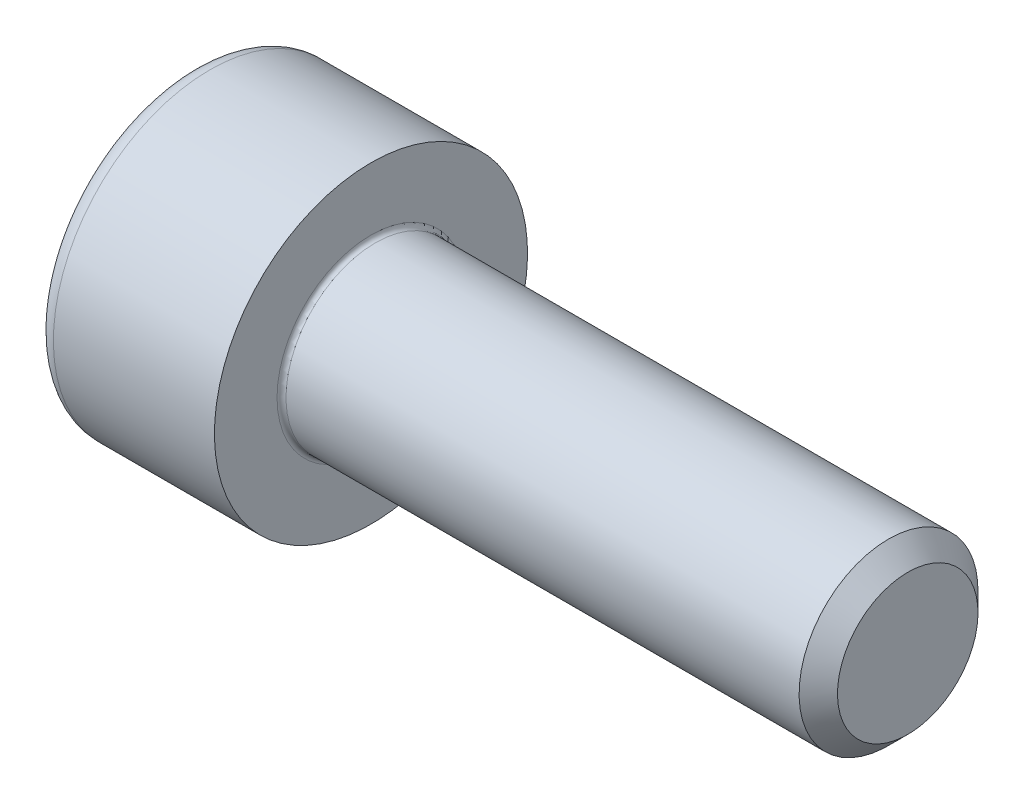
ISO-10303-21;
HEADER;
FILE_DESCRIPTION(('STEP AP214'),'2;1');
FILE_NAME('part.step','',(''),(''),'','','');
FILE_SCHEMA(('AUTOMOTIVE_DESIGN { 1 0 10303 214 1 1 1 1 }'));
ENDSEC;
DATA;
#1=APPLICATION_CONTEXT('core data for automotive mechanical design processes');
#2=APPLICATION_PROTOCOL_DEFINITION('international standard','automotive_design',2000,#1);
#3=PRODUCT_CONTEXT('',#1,'mechanical');
#4=PRODUCT('Part','Part','',(#3));
#5=PRODUCT_RELATED_PRODUCT_CATEGORY('part','',(#4));
#6=PRODUCT_DEFINITION_FORMATION('','',#4);
#7=PRODUCT_DEFINITION_CONTEXT('part definition',#1,'design');
#8=PRODUCT_DEFINITION('design','',#6,#7);
#9=PRODUCT_DEFINITION_SHAPE('','',#8);
#10=(LENGTH_UNIT() NAMED_UNIT(*) SI_UNIT(.MILLI.,.METRE.));
#11=(NAMED_UNIT(*) PLANE_ANGLE_UNIT() SI_UNIT($,.RADIAN.));
#12=(NAMED_UNIT(*) SI_UNIT($,.STERADIAN.) SOLID_ANGLE_UNIT());
#13=UNCERTAINTY_MEASURE_WITH_UNIT(LENGTH_MEASURE(1.E-05),#10,'distance_accuracy_value','');
#14=(GEOMETRIC_REPRESENTATION_CONTEXT(3) GLOBAL_UNCERTAINTY_ASSIGNED_CONTEXT((#13)) GLOBAL_UNIT_ASSIGNED_CONTEXT((#10,
#11,#12)) REPRESENTATION_CONTEXT('',''));
#15=CARTESIAN_POINT('',(0.,0.,0.));
#16=DIRECTION('',(0.,0.,1.));
#17=DIRECTION('',(1.,0.,0.));
#18=AXIS2_PLACEMENT_3D('',#15,#16,#17);
#19=CARTESIAN_POINT('',(0.100000000000002,0.,0.));
#20=DIRECTION('',(1.,0.,0.));
#21=DIRECTION('',(0.,1.,0.));
#22=AXIS2_PLACEMENT_3D('',#19,#20,#21);
#23=TOROIDAL_SURFACE('',#22,2.1,0.1);
#24=CARTESIAN_POINT('',(0.,0.,0.));
#25=DIRECTION('',(1.,0.,0.));
#26=DIRECTION('',(0.,1.,0.));
#27=AXIS2_PLACEMENT_3D('',#24,#25,#26);
#28=CIRCLE('',#27,2.1);
#29=CARTESIAN_POINT('',(0.,2.1,0.));
#30=VERTEX_POINT('',#29);
#31=EDGE_CURVE('E9',#30,#30,#28,.T.);
#32=ORIENTED_EDGE('',*,*,#31,.T.);
#33=EDGE_LOOP('',(#32));
#34=FACE_BOUND('',#33,.T.);
#35=CARTESIAN_POINT('',(0.100000000000002,0.,0.));
#36=DIRECTION('',(-1.,0.,0.));
#37=DIRECTION('',(0.,1.,0.));
#38=AXIS2_PLACEMENT_3D('',#35,#36,#37);
#39=CIRCLE('',#38,2.);
#40=CARTESIAN_POINT('',(0.100000000000002,2.,0.));
#41=VERTEX_POINT('',#40);
#42=EDGE_CURVE('E26',#41,#41,#39,.T.);
#43=ORIENTED_EDGE('',*,*,#42,.T.);
#44=EDGE_LOOP('',(#43));
#45=FACE_BOUND('',#44,.T.);
#46=ADVANCED_FACE('F15',(#34,#45),#23,.F.);
#47=CARTESIAN_POINT('',(6.9147075,0.,0.));
#48=DIRECTION('',(1.,0.,0.));
#49=DIRECTION('',(0.,1.,0.));
#50=AXIS2_PLACEMENT_3D('',#47,#48,#49);
#51=CYLINDRICAL_SURFACE('',#50,2.);
#52=CARTESIAN_POINT('',(11.570585,0.,0.));
#53=DIRECTION('',(1.,0.,0.));
#54=DIRECTION('',(0.,1.,0.));
#55=AXIS2_PLACEMENT_3D('',#52,#53,#54);
#56=CIRCLE('',#55,2.);
#57=CARTESIAN_POINT('',(11.570585,2.,0.));
#58=VERTEX_POINT('',#57);
#59=EDGE_CURVE('E160',#58,#58,#56,.T.);
#60=ORIENTED_EDGE('',*,*,#59,.F.);
#61=EDGE_LOOP('',(#60));
#62=FACE_BOUND('',#61,.T.);
#63=ORIENTED_EDGE('',*,*,#42,.F.);
#64=EDGE_LOOP('',(#63));
#65=FACE_BOUND('',#64,.T.);
#66=ADVANCED_FACE('F170',(#62,#65),#51,.T.);
#67=CARTESIAN_POINT('',(0.,2.75,0.));
#68=DIRECTION('',(1.,0.,0.));
#69=DIRECTION('',(0.,1.,0.));
#70=AXIS2_PLACEMENT_3D('',#67,#68,#69);
#71=PLANE('',#70);
#72=CARTESIAN_POINT('',(0.,0.,0.));
#73=DIRECTION('',(1.,0.,0.));
#74=DIRECTION('',(0.,1.,0.));
#75=AXIS2_PLACEMENT_3D('',#72,#73,#74);
#76=CIRCLE('',#75,3.5);
#77=CARTESIAN_POINT('',(0.,3.5,0.));
#78=VERTEX_POINT('',#77);
#79=EDGE_CURVE('E161',#78,#78,#76,.T.);
#80=ORIENTED_EDGE('',*,*,#79,.T.);
#81=EDGE_LOOP('',(#80));
#82=FACE_BOUND('',#81,.T.);
#83=ORIENTED_EDGE('',*,*,#31,.F.);
#84=EDGE_LOOP('',(#83));
#85=FACE_BOUND('',#84,.T.);
#86=ADVANCED_FACE('F172',(#82,#85),#71,.T.);
#87=CARTESIAN_POINT('',(11.7852925,0.,0.));
#88=DIRECTION('',(-1.,0.,0.));
#89=DIRECTION('',(0.,1.,0.));
#90=AXIS2_PLACEMENT_3D('',#87,#88,#89);
#91=CONICAL_SURFACE('',#90,1.7852925,0.785398163397448);
#92=ORIENTED_EDGE('',*,*,#59,.T.);
#93=EDGE_LOOP('',(#92));
#94=FACE_BOUND('',#93,.T.);
#95=CARTESIAN_POINT('',(12.,0.,0.));
#96=DIRECTION('',(-1.,0.,0.));
#97=DIRECTION('',(0.,1.,0.));
#98=AXIS2_PLACEMENT_3D('',#95,#96,#97);
#99=CIRCLE('',#98,1.570585);
#100=CARTESIAN_POINT('',(12.,1.570585,0.));
#101=VERTEX_POINT('',#100);
#102=EDGE_CURVE('E157',#101,#101,#99,.T.);
#103=ORIENTED_EDGE('',*,*,#102,.T.);
#104=EDGE_LOOP('',(#103));
#105=FACE_BOUND('',#104,.T.);
#106=ADVANCED_FACE('F180',(#94,#105),#91,.T.);
#107=CARTESIAN_POINT('',(12.,1.,0.));
#108=DIRECTION('',(1.,0.,0.));
#109=DIRECTION('',(0.,1.,0.));
#110=AXIS2_PLACEMENT_3D('',#107,#108,#109);
#111=PLANE('',#110);
#112=ORIENTED_EDGE('',*,*,#102,.F.);
#113=EDGE_LOOP('',(#112));
#114=FACE_BOUND('',#113,.T.);
#115=ADVANCED_FACE('F190',(#114),#111,.T.);
#116=CARTESIAN_POINT('',(-3.59999999999999,0.,0.));
#117=DIRECTION('',(1.,0.,0.));
#118=DIRECTION('',(0.,1.,0.));
#119=AXIS2_PLACEMENT_3D('',#116,#117,#118);
#120=TOROIDAL_SURFACE('',#119,3.1,0.4);
#121=CARTESIAN_POINT('',(-3.99999999999999,0.,0.));
#122=DIRECTION('',(1.,0.,0.));
#123=DIRECTION('',(0.,1.,0.));
#124=AXIS2_PLACEMENT_3D('',#121,#122,#123);
#125=CIRCLE('',#124,3.1);
#126=CARTESIAN_POINT('',(-3.99999999999999,3.1,0.));
#127=VERTEX_POINT('',#126);
#128=EDGE_CURVE('E154',#127,#127,#125,.T.);
#129=ORIENTED_EDGE('',*,*,#128,.T.);
#130=EDGE_LOOP('',(#129));
#131=FACE_BOUND('',#130,.T.);
#132=CARTESIAN_POINT('',(-3.59999999999999,0.,0.));
#133=DIRECTION('',(-1.,0.,0.));
#134=DIRECTION('',(0.,1.,0.));
#135=AXIS2_PLACEMENT_3D('',#132,#133,#134);
#136=CIRCLE('',#135,3.5);
#137=CARTESIAN_POINT('',(-3.59999999999999,3.5,0.));
#138=VERTEX_POINT('',#137);
#139=EDGE_CURVE('E151',#138,#138,#136,.T.);
#140=ORIENTED_EDGE('',*,*,#139,.T.);
#141=EDGE_LOOP('',(#140));
#142=FACE_BOUND('',#141,.T.);
#143=ADVANCED_FACE('F204',(#131,#142),#120,.T.);
#144=CARTESIAN_POINT('',(-3.99999999999999,2.61602540378444,0.));
#145=DIRECTION('',(-1.,0.,0.));
#146=DIRECTION('',(0.,-1.,0.));
#147=AXIS2_PLACEMENT_3D('',#144,#145,#146);
#148=PLANE('',#147);
#149=DIRECTION('',(0.,0.,1.));
#150=VECTOR('',#149,1.);
#151=CARTESIAN_POINT('',(-3.99999999999999,1.5,0.433012701892218));
#152=LINE('',#151,#150);
#153=CARTESIAN_POINT('',(-3.99999999999999,1.5,-0.866025403784439));
#154=VERTEX_POINT('',#153);
#155=CARTESIAN_POINT('',(-3.99999999999999,1.5,0.866025403784437));
#156=VERTEX_POINT('',#155);
#157=EDGE_CURVE('E149',#154,#156,#152,.T.);
#158=ORIENTED_EDGE('',*,*,#157,.T.);
#159=DIRECTION('',(0.,-0.866025403784438,0.500000000000001));
#160=VECTOR('',#159,1.);
#161=CARTESIAN_POINT('',(-3.99999999999999,0.375,1.51554445662277));
#162=LINE('',#161,#160);
#163=CARTESIAN_POINT('',(-3.99999999999999,0.,1.73205080756888));
#164=VERTEX_POINT('',#163);
#165=EDGE_CURVE('E38',#156,#164,#162,.T.);
#166=ORIENTED_EDGE('',*,*,#165,.T.);
#167=DIRECTION('',(0.,-0.866025403784439,-0.5));
#168=VECTOR('',#167,1.);
#169=CARTESIAN_POINT('',(-3.99999999999999,-1.125,1.08253175473055));
#170=LINE('',#169,#168);
#171=CARTESIAN_POINT('',(-3.99999999999999,-1.5,0.866025403784439));
#172=VERTEX_POINT('',#171);
#173=EDGE_CURVE('E94',#164,#172,#170,.T.);
#174=ORIENTED_EDGE('',*,*,#173,.T.);
#175=DIRECTION('',(0.,0.,-1.));
#176=VECTOR('',#175,1.);
#177=CARTESIAN_POINT('',(-3.99999999999999,-1.5,-0.433012701892219));
#178=LINE('',#177,#176);
#179=CARTESIAN_POINT('',(-3.99999999999999,-1.5,-0.866025403784438));
#180=VERTEX_POINT('',#179);
#181=EDGE_CURVE('E87',#172,#180,#178,.T.);
#182=ORIENTED_EDGE('',*,*,#181,.T.);
#183=DIRECTION('',(0.,0.866025403784439,-0.5));
#184=VECTOR('',#183,1.);
#185=CARTESIAN_POINT('',(-3.99999999999999,-0.375000000000001,-1.51554445662277));
#186=LINE('',#185,#184);
#187=CARTESIAN_POINT('',(-3.99999999999999,0.,-1.73205080756888));
#188=VERTEX_POINT('',#187);
#189=EDGE_CURVE('E143',#180,#188,#186,.T.);
#190=ORIENTED_EDGE('',*,*,#189,.T.);
#191=DIRECTION('',(0.,0.866025403784439,0.5));
#192=VECTOR('',#191,1.);
#193=CARTESIAN_POINT('',(-3.99999999999999,1.125,-1.08253175473055));
#194=LINE('',#193,#192);
#195=EDGE_CURVE('E134',#188,#154,#194,.T.);
#196=ORIENTED_EDGE('',*,*,#195,.T.);
#197=EDGE_LOOP('',(#158,#166,#174,#182,#190,#196));
#198=FACE_BOUND('',#197,.T.);
#199=ORIENTED_EDGE('',*,*,#128,.F.);
#200=EDGE_LOOP('',(#199));
#201=FACE_BOUND('',#200,.T.);
#202=ADVANCED_FACE('F195',(#198,#201),#148,.T.);
#203=CARTESIAN_POINT('',(-2.,0.,0.));
#204=DIRECTION('',(1.,0.,0.));
#205=DIRECTION('',(0.,1.,0.));
#206=AXIS2_PLACEMENT_3D('',#203,#204,#205);
#207=CYLINDRICAL_SURFACE('',#206,3.5);
#208=ORIENTED_EDGE('',*,*,#79,.F.);
#209=EDGE_LOOP('',(#208));
#210=FACE_BOUND('',#209,.T.);
#211=ORIENTED_EDGE('',*,*,#139,.F.);
#212=EDGE_LOOP('',(#211));
#213=FACE_BOUND('',#212,.T.);
#214=ADVANCED_FACE('F192',(#210,#213),#207,.T.);
#215=CARTESIAN_POINT('',(-3.99999999999999,0.,-1.73205080756888));
#216=DIRECTION('',(0.,-0.5,-0.866025403784439));
#217=DIRECTION('',(0.,0.866025403784439,-0.5));
#218=AXIS2_PLACEMENT_3D('',#215,#216,#217);
#219=PLANE('',#218);
#220=CARTESIAN_POINT('',(-1.99999999999999,0.,-1.73205080756888));
#221=CARTESIAN_POINT('',(-1.74999999999999,-0.750000000000001,-1.29903810567666));
#222=CARTESIAN_POINT('',(-1.99999999999999,-1.50000000000001,-0.866025403784435));
#223=(BOUNDED_CURVE() B_SPLINE_CURVE(2,(#220,#221,#222),.UNSPECIFIED.,.F.,
.F.) B_SPLINE_CURVE_WITH_KNOTS((3,3),(0.,0.175265420711689),
.UNSPECIFIED.) CURVE() GEOMETRIC_REPRESENTATION_ITEM() RATIONAL_B_SPLINE_CURVE((1.,
1.15470053837926,1.)) REPRESENTATION_ITEM(''));
#224=CARTESIAN_POINT('',(-1.99999999999999,0.,-1.73205080756888));
#225=VERTEX_POINT('',#224);
#226=CARTESIAN_POINT('',(-1.99999999999999,-1.5,-0.866025403784438));
#227=VERTEX_POINT('',#226);
#228=EDGE_CURVE('E78',#225,#227,#223,.T.);
#229=ORIENTED_EDGE('',*,*,#228,.F.);
#230=DIRECTION('',(-1.,0.,0.));
#231=VECTOR('',#230,1.);
#232=CARTESIAN_POINT('',(-2.99999999999999,0.,-1.73205080756888));
#233=LINE('',#232,#231);
#234=EDGE_CURVE('E124',#225,#188,#233,.T.);
#235=ORIENTED_EDGE('',*,*,#234,.T.);
#236=ORIENTED_EDGE('',*,*,#189,.F.);
#237=DIRECTION('',(-1.,0.,0.));
#238=VECTOR('',#237,1.);
#239=CARTESIAN_POINT('',(-2.99999999999999,-1.5,-0.866025403784438));
#240=LINE('',#239,#238);
#241=EDGE_CURVE('E90',#227,#180,#240,.T.);
#242=ORIENTED_EDGE('',*,*,#241,.F.);
#243=EDGE_LOOP('',(#229,#235,#236,#242));
#244=FACE_BOUND('',#243,.T.);
#245=ADVANCED_FACE('F194',(#244),#219,.F.);
#246=CARTESIAN_POINT('',(-3.99999999999999,1.5,-0.866025403784439));
#247=DIRECTION('',(0.,0.5,-0.866025403784439));
#248=DIRECTION('',(0.,0.866025403784439,0.5));
#249=AXIS2_PLACEMENT_3D('',#246,#247,#248);
#250=PLANE('',#249);
#251=CARTESIAN_POINT('',(-1.99999999999999,1.5,-0.866025403784436));
#252=CARTESIAN_POINT('',(-1.74999999999999,0.749999999999999,-1.29903810567666));
#253=CARTESIAN_POINT('',(-1.99999999999999,0.,-1.73205080756888));
#254=(BOUNDED_CURVE() B_SPLINE_CURVE(2,(#251,#252,#253),.UNSPECIFIED.,.F.,
.F.) B_SPLINE_CURVE_WITH_KNOTS((3,3),(0.,0.175265420711689),
.UNSPECIFIED.) CURVE() GEOMETRIC_REPRESENTATION_ITEM() RATIONAL_B_SPLINE_CURVE((1.,
1.15470053837925,1.)) REPRESENTATION_ITEM(''));
#255=CARTESIAN_POINT('',(-1.99999999999999,1.5,-0.866025403784441));
#256=VERTEX_POINT('',#255);
#257=EDGE_CURVE('E118',#256,#225,#254,.T.);
#258=ORIENTED_EDGE('',*,*,#257,.F.);
#259=DIRECTION('',(-1.,0.,0.));
#260=VECTOR('',#259,1.);
#261=CARTESIAN_POINT('',(-2.99999999999999,1.5,-0.866025403784441));
#262=LINE('',#261,#260);
#263=EDGE_CURVE('E113',#256,#154,#262,.T.);
#264=ORIENTED_EDGE('',*,*,#263,.T.);
#265=ORIENTED_EDGE('',*,*,#195,.F.);
#266=ORIENTED_EDGE('',*,*,#234,.F.);
#267=EDGE_LOOP('',(#258,#264,#265,#266));
#268=FACE_BOUND('',#267,.T.);
#269=ADVANCED_FACE('F201',(#268),#250,.F.);
#270=CARTESIAN_POINT('',(-3.99999999999999,1.5,0.866025403784437));
#271=DIRECTION('',(0.,1.,0.));
#272=DIRECTION('',(0.,0.,1.));
#273=AXIS2_PLACEMENT_3D('',#270,#271,#272);
#274=PLANE('',#273);
#275=CARTESIAN_POINT('',(-1.99999999999999,1.5,0.866025403784444));
#276=CARTESIAN_POINT('',(-1.74999999999999,1.5,0.));
#277=CARTESIAN_POINT('',(-1.99999999999999,1.5,-0.866025403784447));
#278=(BOUNDED_CURVE() B_SPLINE_CURVE(2,(#275,#276,#277),.UNSPECIFIED.,.F.,
.F.) B_SPLINE_CURVE_WITH_KNOTS((3,3),(0.,0.175265420711689),
.UNSPECIFIED.) CURVE() GEOMETRIC_REPRESENTATION_ITEM() RATIONAL_B_SPLINE_CURVE((1.,
1.15470053837926,1.)) REPRESENTATION_ITEM(''));
#279=CARTESIAN_POINT('',(-1.99999999999999,1.5,0.866025403784436));
#280=VERTEX_POINT('',#279);
#281=EDGE_CURVE('E97',#280,#256,#278,.T.);
#282=ORIENTED_EDGE('',*,*,#281,.F.);
#283=DIRECTION('',(-1.,0.,0.));
#284=VECTOR('',#283,1.);
#285=CARTESIAN_POINT('',(-2.99999999999999,1.5,0.866025403784436));
#286=LINE('',#285,#284);
#287=EDGE_CURVE('E107',#280,#156,#286,.T.);
#288=ORIENTED_EDGE('',*,*,#287,.T.);
#289=ORIENTED_EDGE('',*,*,#157,.F.);
#290=ORIENTED_EDGE('',*,*,#263,.F.);
#291=EDGE_LOOP('',(#282,#288,#289,#290));
#292=FACE_BOUND('',#291,.T.);
#293=ADVANCED_FACE('F222',(#292),#274,.F.);
#294=CARTESIAN_POINT('',(-3.99999999999999,0.,1.73205080756888));
#295=DIRECTION('',(0.,0.500000000000001,0.866025403784438));
#296=DIRECTION('',(0.,-0.866025403784438,0.500000000000001));
#297=AXIS2_PLACEMENT_3D('',#294,#295,#296);
#298=PLANE('',#297);
#299=CARTESIAN_POINT('',(-1.99999999999999,0.,1.73205080756888));
#300=CARTESIAN_POINT('',(-1.74999999999999,0.75,1.29903810567666));
#301=CARTESIAN_POINT('',(-1.99999999999999,1.50000000000001,0.866025403784433));
#302=(BOUNDED_CURVE() B_SPLINE_CURVE(2,(#299,#300,#301),.UNSPECIFIED.,.F.,
.F.) B_SPLINE_CURVE_WITH_KNOTS((3,3),(0.,0.175265420711689),
.UNSPECIFIED.) CURVE() GEOMETRIC_REPRESENTATION_ITEM() RATIONAL_B_SPLINE_CURVE((1.,
1.15470053837925,1.)) REPRESENTATION_ITEM(''));
#303=CARTESIAN_POINT('',(-1.99999999999999,0.,1.73205080756888));
#304=VERTEX_POINT('',#303);
#305=EDGE_CURVE('E95',#304,#280,#302,.T.);
#306=ORIENTED_EDGE('',*,*,#305,.F.);
#307=DIRECTION('',(1.,0.,0.));
#308=VECTOR('',#307,1.);
#309=CARTESIAN_POINT('',(-2.99999999999999,0.,1.73205080756888));
#310=LINE('',#309,#308);
#311=EDGE_CURVE('E91',#164,#304,#310,.T.);
#312=ORIENTED_EDGE('',*,*,#311,.F.);
#313=ORIENTED_EDGE('',*,*,#165,.F.);
#314=ORIENTED_EDGE('',*,*,#287,.F.);
#315=EDGE_LOOP('',(#306,#312,#313,#314));
#316=FACE_BOUND('',#315,.T.);
#317=ADVANCED_FACE('F226',(#316),#298,.F.);
#318=CARTESIAN_POINT('',(-3.99999999999999,-1.5,-0.866025403784438));
#319=DIRECTION('',(0.,-1.,0.));
#320=DIRECTION('',(0.,0.,-1.));
#321=AXIS2_PLACEMENT_3D('',#318,#319,#320);
#322=PLANE('',#321);
#323=CARTESIAN_POINT('',(-1.99999999999999,-1.5,-0.866025403784445));
#324=CARTESIAN_POINT('',(-1.74999999999999,-1.5,0.));
#325=CARTESIAN_POINT('',(-1.99999999999999,-1.5,0.866025403784446));
#326=(BOUNDED_CURVE() B_SPLINE_CURVE(2,(#323,#324,#325),.UNSPECIFIED.,.F.,
.F.) B_SPLINE_CURVE_WITH_KNOTS((3,3),(0.,0.175265420711689),
.UNSPECIFIED.) CURVE() GEOMETRIC_REPRESENTATION_ITEM() RATIONAL_B_SPLINE_CURVE((1.,
1.15470053837925,1.)) REPRESENTATION_ITEM(''));
#327=CARTESIAN_POINT('',(-1.99999999999999,-1.5,0.866025403784439));
#328=VERTEX_POINT('',#327);
#329=EDGE_CURVE('E73',#227,#328,#326,.T.);
#330=ORIENTED_EDGE('',*,*,#329,.F.);
#331=ORIENTED_EDGE('',*,*,#241,.T.);
#332=ORIENTED_EDGE('',*,*,#181,.F.);
#333=DIRECTION('',(-1.,0.,0.));
#334=VECTOR('',#333,1.);
#335=CARTESIAN_POINT('',(-2.99999999999999,-1.5,0.866025403784439));
#336=LINE('',#335,#334);
#337=EDGE_CURVE('E84',#328,#172,#336,.T.);
#338=ORIENTED_EDGE('',*,*,#337,.F.);
#339=EDGE_LOOP('',(#330,#331,#332,#338));
#340=FACE_BOUND('',#339,.T.);
#341=ADVANCED_FACE('F85',(#340),#322,.F.);
#342=CARTESIAN_POINT('',(-3.99999999999999,-1.5,0.866025403784439));
#343=DIRECTION('',(0.,-0.5,0.866025403784439));
#344=DIRECTION('',(0.,-0.866025403784439,-0.5));
#345=AXIS2_PLACEMENT_3D('',#342,#343,#344);
#346=PLANE('',#345);
#347=CARTESIAN_POINT('',(-1.99999999999999,-1.50000000000001,0.866025403784435));
#348=CARTESIAN_POINT('',(-1.74999999999999,-0.750000000000001,1.29903810567666));
#349=CARTESIAN_POINT('',(-1.99999999999999,0.,1.73205080756888));
#350=(BOUNDED_CURVE() B_SPLINE_CURVE(2,(#347,#348,#349),.UNSPECIFIED.,.F.,
.F.) B_SPLINE_CURVE_WITH_KNOTS((3,3),(0.,0.175265420711689),
.UNSPECIFIED.) CURVE() GEOMETRIC_REPRESENTATION_ITEM() RATIONAL_B_SPLINE_CURVE((1.,
1.15470053837925,1.)) REPRESENTATION_ITEM(''));
#351=EDGE_CURVE('E19',#328,#304,#350,.T.);
#352=ORIENTED_EDGE('',*,*,#351,.F.);
#353=ORIENTED_EDGE('',*,*,#337,.T.);
#354=ORIENTED_EDGE('',*,*,#173,.F.);
#355=ORIENTED_EDGE('',*,*,#311,.T.);
#356=EDGE_LOOP('',(#352,#353,#354,#355));
#357=FACE_BOUND('',#356,.T.);
#358=ADVANCED_FACE('F93',(#357),#346,.F.);
#359=CARTESIAN_POINT('',(-1.49999999999999,0.,0.));
#360=DIRECTION('',(-1.,0.,0.));
#361=DIRECTION('',(0.,1.,0.));
#362=AXIS2_PLACEMENT_3D('',#359,#360,#361);
#363=CONICAL_SURFACE('',#362,0.866025403784439,1.0471975511966);
#364=CARTESIAN_POINT('',(-0.999999999999993,0.,0.));
#365=VERTEX_POINT('',#364);
#366=VERTEX_LOOP('',#365);
#367=FACE_BOUND('',#366,.T.);
#368=ORIENTED_EDGE('',*,*,#305,.T.);
#369=ORIENTED_EDGE('',*,*,#281,.T.);
#370=ORIENTED_EDGE('',*,*,#257,.T.);
#371=ORIENTED_EDGE('',*,*,#228,.T.);
#372=ORIENTED_EDGE('',*,*,#329,.T.);
#373=ORIENTED_EDGE('',*,*,#351,.T.);
#374=EDGE_LOOP('',(#368,#369,#370,#371,#372,#373));
#375=FACE_BOUND('',#374,.T.);
#376=ADVANCED_FACE('F17',(#367,#375),#363,.F.);
#377=CLOSED_SHELL('',(#46,#66,#86,#106,#115,#143,#202,#214,#245,#269,#293,#317,#341,#358,#376));
#378=MANIFOLD_SOLID_BREP('B1',#377);
#379=ADVANCED_BREP_SHAPE_REPRESENTATION('',(#18,#378),#14);
#380=SHAPE_DEFINITION_REPRESENTATION(#9,#379);
ENDSEC;
END-ISO-10303-21;
